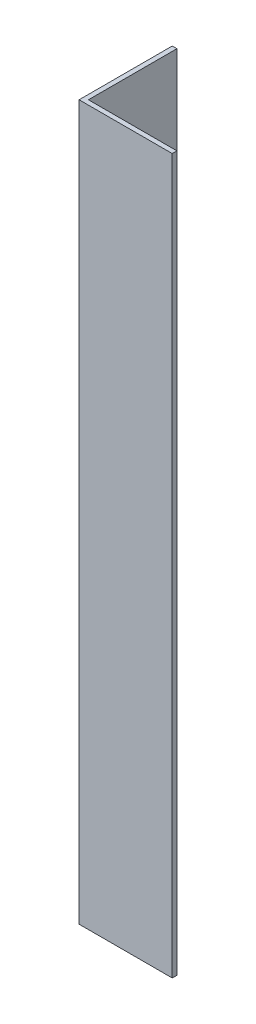
ISO-10303-21;
HEADER;
FILE_DESCRIPTION(('STEP AP214'),'2;1');
FILE_NAME('part.step','',(''),(''),'','','');
FILE_SCHEMA(('AUTOMOTIVE_DESIGN { 1 0 10303 214 1 1 1 1 }'));
ENDSEC;
DATA;
#1=APPLICATION_CONTEXT('core data for automotive mechanical design processes');
#2=APPLICATION_PROTOCOL_DEFINITION('international standard','automotive_design',2000,#1);
#3=PRODUCT_CONTEXT('',#1,'mechanical');
#4=PRODUCT('Part','Part','',(#3));
#5=PRODUCT_RELATED_PRODUCT_CATEGORY('part','',(#4));
#6=PRODUCT_DEFINITION_FORMATION('','',#4);
#7=PRODUCT_DEFINITION_CONTEXT('part definition',#1,'design');
#8=PRODUCT_DEFINITION('design','',#6,#7);
#9=PRODUCT_DEFINITION_SHAPE('','',#8);
#10=(LENGTH_UNIT() NAMED_UNIT(*) SI_UNIT(.MILLI.,.METRE.));
#11=(NAMED_UNIT(*) PLANE_ANGLE_UNIT() SI_UNIT($,.RADIAN.));
#12=(NAMED_UNIT(*) SI_UNIT($,.STERADIAN.) SOLID_ANGLE_UNIT());
#13=UNCERTAINTY_MEASURE_WITH_UNIT(LENGTH_MEASURE(1.E-05),#10,'distance_accuracy_value','');
#14=(GEOMETRIC_REPRESENTATION_CONTEXT(3) GLOBAL_UNCERTAINTY_ASSIGNED_CONTEXT((#13)) GLOBAL_UNIT_ASSIGNED_CONTEXT((#10,
#11,#12)) REPRESENTATION_CONTEXT('',''));
#15=CARTESIAN_POINT('',(0.,0.,0.));
#16=DIRECTION('',(0.,0.,1.));
#17=DIRECTION('',(1.,0.,0.));
#18=AXIS2_PLACEMENT_3D('',#15,#16,#17);
#19=CARTESIAN_POINT('',(15.,115.,0.));
#20=DIRECTION('',(0.,0.,-1.));
#21=DIRECTION('',(-1.,0.,0.));
#22=AXIS2_PLACEMENT_3D('',#19,#20,#21);
#23=PLANE('',#22);
#24=DIRECTION('',(1.,0.,0.));
#25=VECTOR('',#24,1.);
#26=CARTESIAN_POINT('',(15.,0.,0.));
#27=LINE('',#26,#25);
#28=CARTESIAN_POINT('',(0.,0.,0.));
#29=VERTEX_POINT('',#28);
#30=CARTESIAN_POINT('',(15.,0.,0.));
#31=VERTEX_POINT('',#30);
#32=EDGE_CURVE('E120',#29,#31,#27,.T.);
#33=ORIENTED_EDGE('',*,*,#32,.T.);
#34=DIRECTION('',(0.,-1.,0.));
#35=VECTOR('',#34,1.);
#36=CARTESIAN_POINT('',(15.,115.,0.));
#37=LINE('',#36,#35);
#38=CARTESIAN_POINT('',(15.,115.,0.));
#39=VERTEX_POINT('',#38);
#40=EDGE_CURVE('E11',#39,#31,#37,.T.);
#41=ORIENTED_EDGE('',*,*,#40,.F.);
#42=DIRECTION('',(1.,0.,0.));
#43=VECTOR('',#42,1.);
#44=CARTESIAN_POINT('',(15.,115.,0.));
#45=LINE('',#44,#43);
#46=CARTESIAN_POINT('',(0.,115.,0.));
#47=VERTEX_POINT('',#46);
#48=EDGE_CURVE('E130',#47,#39,#45,.T.);
#49=ORIENTED_EDGE('',*,*,#48,.F.);
#50=DIRECTION('',(0.,-1.,0.));
#51=VECTOR('',#50,1.);
#52=CARTESIAN_POINT('',(0.,115.,0.));
#53=LINE('',#52,#51);
#54=EDGE_CURVE('E116',#47,#29,#53,.T.);
#55=ORIENTED_EDGE('',*,*,#54,.T.);
#56=EDGE_LOOP('',(#33,#41,#49,#55));
#57=FACE_BOUND('',#56,.T.);
#58=ADVANCED_FACE('F36',(#57),#23,.F.);
#59=CARTESIAN_POINT('',(15.,115.,-0.749999999999998));
#60=DIRECTION('',(-1.,0.,0.));
#61=DIRECTION('',(0.,0.,1.));
#62=AXIS2_PLACEMENT_3D('',#59,#60,#61);
#63=PLANE('',#62);
#64=DIRECTION('',(0.,0.,-1.));
#65=VECTOR('',#64,1.);
#66=CARTESIAN_POINT('',(15.,0.,-0.749999999999998));
#67=LINE('',#66,#65);
#68=CARTESIAN_POINT('',(15.,0.,-0.749999999999998));
#69=VERTEX_POINT('',#68);
#70=EDGE_CURVE('E123',#31,#69,#67,.T.);
#71=ORIENTED_EDGE('',*,*,#70,.T.);
#72=DIRECTION('',(0.,-1.,0.));
#73=VECTOR('',#72,1.);
#74=CARTESIAN_POINT('',(15.,115.,-0.749999999999998));
#75=LINE('',#74,#73);
#76=CARTESIAN_POINT('',(15.,115.,-0.749999999999998));
#77=VERTEX_POINT('',#76);
#78=EDGE_CURVE('E44',#77,#69,#75,.T.);
#79=ORIENTED_EDGE('',*,*,#78,.F.);
#80=DIRECTION('',(0.,0.,-1.));
#81=VECTOR('',#80,1.);
#82=CARTESIAN_POINT('',(15.,115.,-0.749999999999998));
#83=LINE('',#82,#81);
#84=EDGE_CURVE('E89',#39,#77,#83,.T.);
#85=ORIENTED_EDGE('',*,*,#84,.F.);
#86=ORIENTED_EDGE('',*,*,#40,.T.);
#87=EDGE_LOOP('',(#71,#79,#85,#86));
#88=FACE_BOUND('',#87,.T.);
#89=ADVANCED_FACE('F154',(#88),#63,.F.);
#90=CARTESIAN_POINT('',(0.749999999999998,115.,-0.749999999999998));
#91=DIRECTION('',(0.,0.,1.));
#92=DIRECTION('',(1.,0.,0.));
#93=AXIS2_PLACEMENT_3D('',#90,#91,#92);
#94=PLANE('',#93);
#95=DIRECTION('',(-1.,0.,0.));
#96=VECTOR('',#95,1.);
#97=CARTESIAN_POINT('',(0.749999999999998,0.,-0.749999999999998));
#98=LINE('',#97,#96);
#99=CARTESIAN_POINT('',(0.749999999999998,0.,-0.749999999999998));
#100=VERTEX_POINT('',#99);
#101=EDGE_CURVE('E125',#69,#100,#98,.T.);
#102=ORIENTED_EDGE('',*,*,#101,.T.);
#103=DIRECTION('',(0.,-1.,0.));
#104=VECTOR('',#103,1.);
#105=CARTESIAN_POINT('',(0.749999999999998,115.,-0.749999999999998));
#106=LINE('',#105,#104);
#107=CARTESIAN_POINT('',(0.749999999999998,115.,-0.749999999999998));
#108=VERTEX_POINT('',#107);
#109=EDGE_CURVE('E111',#108,#100,#106,.T.);
#110=ORIENTED_EDGE('',*,*,#109,.F.);
#111=DIRECTION('',(-1.,0.,0.));
#112=VECTOR('',#111,1.);
#113=CARTESIAN_POINT('',(0.749999999999998,115.,-0.749999999999998));
#114=LINE('',#113,#112);
#115=EDGE_CURVE('E102',#77,#108,#114,.T.);
#116=ORIENTED_EDGE('',*,*,#115,.F.);
#117=ORIENTED_EDGE('',*,*,#78,.T.);
#118=EDGE_LOOP('',(#102,#110,#116,#117));
#119=FACE_BOUND('',#118,.T.);
#120=ADVANCED_FACE('F136',(#119),#94,.F.);
#121=CARTESIAN_POINT('',(0.749999999999998,115.,-15.));
#122=DIRECTION('',(-1.,0.,0.));
#123=DIRECTION('',(0.,0.,1.));
#124=AXIS2_PLACEMENT_3D('',#121,#122,#123);
#125=PLANE('',#124);
#126=DIRECTION('',(0.,0.,-1.));
#127=VECTOR('',#126,1.);
#128=CARTESIAN_POINT('',(0.749999999999998,0.,-15.));
#129=LINE('',#128,#127);
#130=CARTESIAN_POINT('',(0.749999999999998,0.,-15.));
#131=VERTEX_POINT('',#130);
#132=EDGE_CURVE('E110',#100,#131,#129,.T.);
#133=ORIENTED_EDGE('',*,*,#132,.T.);
#134=DIRECTION('',(0.,-1.,0.));
#135=VECTOR('',#134,1.);
#136=CARTESIAN_POINT('',(0.749999999999998,115.,-15.));
#137=LINE('',#136,#135);
#138=CARTESIAN_POINT('',(0.749999999999998,115.,-15.));
#139=VERTEX_POINT('',#138);
#140=EDGE_CURVE('E107',#139,#131,#137,.T.);
#141=ORIENTED_EDGE('',*,*,#140,.F.);
#142=DIRECTION('',(0.,0.,-1.));
#143=VECTOR('',#142,1.);
#144=CARTESIAN_POINT('',(0.749999999999998,115.,-15.));
#145=LINE('',#144,#143);
#146=EDGE_CURVE('E96',#108,#139,#145,.T.);
#147=ORIENTED_EDGE('',*,*,#146,.F.);
#148=ORIENTED_EDGE('',*,*,#109,.T.);
#149=EDGE_LOOP('',(#133,#141,#147,#148));
#150=FACE_BOUND('',#149,.T.);
#151=ADVANCED_FACE('F108',(#150),#125,.F.);
#152=CARTESIAN_POINT('',(0.,115.,-15.));
#153=DIRECTION('',(0.,0.,1.));
#154=DIRECTION('',(1.,0.,0.));
#155=AXIS2_PLACEMENT_3D('',#152,#153,#154);
#156=PLANE('',#155);
#157=DIRECTION('',(-1.,0.,0.));
#158=VECTOR('',#157,1.);
#159=CARTESIAN_POINT('',(0.,0.,-15.));
#160=LINE('',#159,#158);
#161=CARTESIAN_POINT('',(0.,0.,-15.));
#162=VERTEX_POINT('',#161);
#163=EDGE_CURVE('E75',#131,#162,#160,.T.);
#164=ORIENTED_EDGE('',*,*,#163,.T.);
#165=DIRECTION('',(0.,-1.,0.));
#166=VECTOR('',#165,1.);
#167=CARTESIAN_POINT('',(0.,115.,-15.));
#168=LINE('',#167,#166);
#169=CARTESIAN_POINT('',(0.,115.,-15.));
#170=VERTEX_POINT('',#169);
#171=EDGE_CURVE('E112',#170,#162,#168,.T.);
#172=ORIENTED_EDGE('',*,*,#171,.F.);
#173=DIRECTION('',(-1.,0.,0.));
#174=VECTOR('',#173,1.);
#175=CARTESIAN_POINT('',(0.,115.,-15.));
#176=LINE('',#175,#174);
#177=EDGE_CURVE('E100',#139,#170,#176,.T.);
#178=ORIENTED_EDGE('',*,*,#177,.F.);
#179=ORIENTED_EDGE('',*,*,#140,.T.);
#180=EDGE_LOOP('',(#164,#172,#178,#179));
#181=FACE_BOUND('',#180,.T.);
#182=ADVANCED_FACE('F114',(#181),#156,.F.);
#183=CARTESIAN_POINT('',(0.,115.,0.));
#184=DIRECTION('',(1.,0.,0.));
#185=DIRECTION('',(0.,0.,-1.));
#186=AXIS2_PLACEMENT_3D('',#183,#184,#185);
#187=PLANE('',#186);
#188=DIRECTION('',(0.,0.,1.));
#189=VECTOR('',#188,1.);
#190=CARTESIAN_POINT('',(0.,0.,0.));
#191=LINE('',#190,#189);
#192=EDGE_CURVE('E81',#162,#29,#191,.T.);
#193=ORIENTED_EDGE('',*,*,#192,.T.);
#194=ORIENTED_EDGE('',*,*,#54,.F.);
#195=DIRECTION('',(0.,0.,1.));
#196=VECTOR('',#195,1.);
#197=CARTESIAN_POINT('',(0.,115.,0.));
#198=LINE('',#197,#196);
#199=EDGE_CURVE('E52',#170,#47,#198,.T.);
#200=ORIENTED_EDGE('',*,*,#199,.F.);
#201=ORIENTED_EDGE('',*,*,#171,.T.);
#202=EDGE_LOOP('',(#193,#194,#200,#201));
#203=FACE_BOUND('',#202,.T.);
#204=ADVANCED_FACE('F143',(#203),#187,.F.);
#205=CARTESIAN_POINT('',(0.,115.,0.));
#206=DIRECTION('',(0.,-1.,0.));
#207=DIRECTION('',(0.,0.,-1.));
#208=AXIS2_PLACEMENT_3D('',#205,#206,#207);
#209=PLANE('',#208);
#210=ORIENTED_EDGE('',*,*,#48,.T.);
#211=ORIENTED_EDGE('',*,*,#84,.T.);
#212=ORIENTED_EDGE('',*,*,#115,.T.);
#213=ORIENTED_EDGE('',*,*,#146,.T.);
#214=ORIENTED_EDGE('',*,*,#177,.T.);
#215=ORIENTED_EDGE('',*,*,#199,.T.);
#216=EDGE_LOOP('',(#210,#211,#212,#213,#214,#215));
#217=FACE_BOUND('',#216,.T.);
#218=ADVANCED_FACE('F98',(#217),#209,.F.);
#219=CARTESIAN_POINT('',(0.,0.,0.));
#220=DIRECTION('',(0.,-1.,0.));
#221=DIRECTION('',(0.,0.,-1.));
#222=AXIS2_PLACEMENT_3D('',#219,#220,#221);
#223=PLANE('',#222);
#224=ORIENTED_EDGE('',*,*,#32,.F.);
#225=ORIENTED_EDGE('',*,*,#192,.F.);
#226=ORIENTED_EDGE('',*,*,#163,.F.);
#227=ORIENTED_EDGE('',*,*,#132,.F.);
#228=ORIENTED_EDGE('',*,*,#101,.F.);
#229=ORIENTED_EDGE('',*,*,#70,.F.);
#230=EDGE_LOOP('',(#224,#225,#226,#227,#228,#229));
#231=FACE_BOUND('',#230,.T.);
#232=ADVANCED_FACE('F139',(#231),#223,.T.);
#233=CLOSED_SHELL('',(#58,#89,#120,#151,#182,#204,#218,#232));
#234=MANIFOLD_SOLID_BREP('B2',#233);
#235=ADVANCED_BREP_SHAPE_REPRESENTATION('',(#18,#234),#14);
#236=SHAPE_DEFINITION_REPRESENTATION(#9,#235);
ENDSEC;
END-ISO-10303-21;
